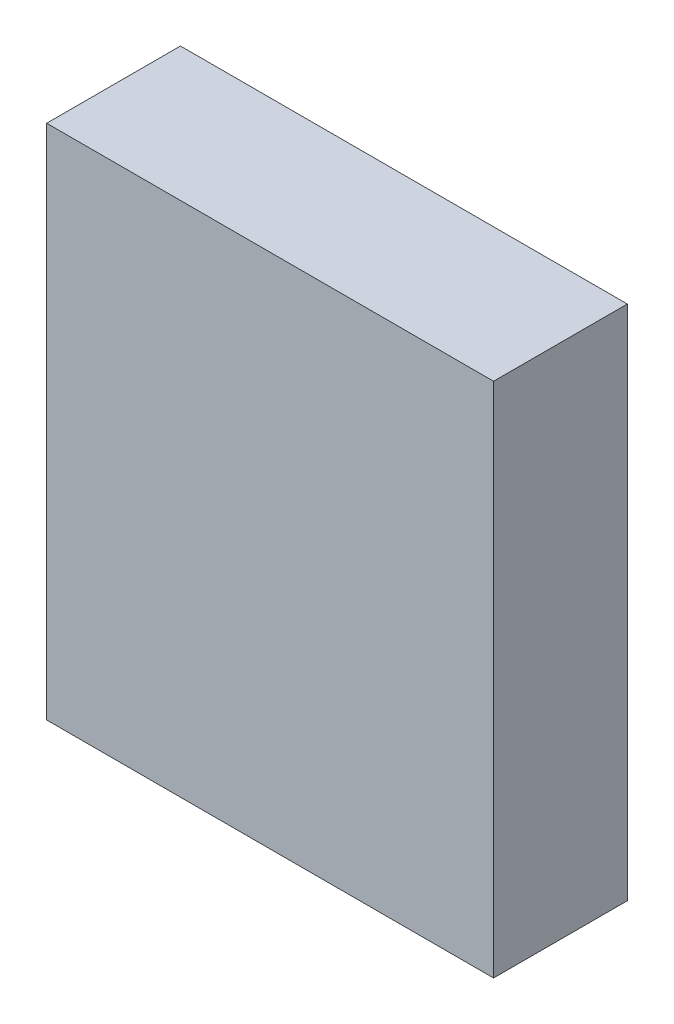
ISO-10303-21;
HEADER;
FILE_DESCRIPTION(('STEP AP214'),'2;1');
FILE_NAME('part.step','',(''),(''),'','','');
FILE_SCHEMA(('AUTOMOTIVE_DESIGN { 1 0 10303 214 1 1 1 1 }'));
ENDSEC;
DATA;
#1=APPLICATION_CONTEXT('core data for automotive mechanical design processes');
#2=APPLICATION_PROTOCOL_DEFINITION('international standard','automotive_design',2000,#1);
#3=PRODUCT_CONTEXT('',#1,'mechanical');
#4=PRODUCT('Part','Part','',(#3));
#5=PRODUCT_RELATED_PRODUCT_CATEGORY('part','',(#4));
#6=PRODUCT_DEFINITION_FORMATION('','',#4);
#7=PRODUCT_DEFINITION_CONTEXT('part definition',#1,'design');
#8=PRODUCT_DEFINITION('design','',#6,#7);
#9=PRODUCT_DEFINITION_SHAPE('','',#8);
#10=(LENGTH_UNIT() NAMED_UNIT(*) SI_UNIT(.MILLI.,.METRE.));
#11=(NAMED_UNIT(*) PLANE_ANGLE_UNIT() SI_UNIT($,.RADIAN.));
#12=(NAMED_UNIT(*) SI_UNIT($,.STERADIAN.) SOLID_ANGLE_UNIT());
#13=UNCERTAINTY_MEASURE_WITH_UNIT(LENGTH_MEASURE(1.E-05),#10,'distance_accuracy_value','');
#14=(GEOMETRIC_REPRESENTATION_CONTEXT(3) GLOBAL_UNCERTAINTY_ASSIGNED_CONTEXT((#13)) GLOBAL_UNIT_ASSIGNED_CONTEXT((#10,
#11,#12)) REPRESENTATION_CONTEXT('',''));
#15=CARTESIAN_POINT('',(0.,0.,0.));
#16=DIRECTION('',(0.,0.,1.));
#17=DIRECTION('',(1.,0.,0.));
#18=AXIS2_PLACEMENT_3D('',#15,#16,#17);
#19=CARTESIAN_POINT('',(0.,1700.,0.));
#20=DIRECTION('',(-1.,0.,0.));
#21=DIRECTION('',(0.,0.,1.));
#22=AXIS2_PLACEMENT_3D('',#19,#20,#21);
#23=PLANE('',#22);
#24=DIRECTION('',(0.,0.,-1.));
#25=VECTOR('',#24,1.);
#26=CARTESIAN_POINT('',(0.,0.,0.));
#27=LINE('',#26,#25);
#28=CARTESIAN_POINT('',(0.,0.,0.));
#29=VERTEX_POINT('',#28);
#30=CARTESIAN_POINT('',(0.,0.,-440.));
#31=VERTEX_POINT('',#30);
#32=EDGE_CURVE('E98',#29,#31,#27,.T.);
#33=ORIENTED_EDGE('',*,*,#32,.T.);
#34=DIRECTION('',(0.,-1.,0.));
#35=VECTOR('',#34,1.);
#36=CARTESIAN_POINT('',(0.,1700.,-440.));
#37=LINE('',#36,#35);
#38=CARTESIAN_POINT('',(0.,1700.,-440.));
#39=VERTEX_POINT('',#38);
#40=EDGE_CURVE('E11',#39,#31,#37,.T.);
#41=ORIENTED_EDGE('',*,*,#40,.F.);
#42=DIRECTION('',(0.,0.,-1.));
#43=VECTOR('',#42,1.);
#44=CARTESIAN_POINT('',(0.,1700.,0.));
#45=LINE('',#44,#43);
#46=CARTESIAN_POINT('',(0.,1700.,0.));
#47=VERTEX_POINT('',#46);
#48=EDGE_CURVE('E86',#47,#39,#45,.T.);
#49=ORIENTED_EDGE('',*,*,#48,.F.);
#50=DIRECTION('',(0.,-1.,0.));
#51=VECTOR('',#50,1.);
#52=CARTESIAN_POINT('',(0.,1700.,0.));
#53=LINE('',#52,#51);
#54=EDGE_CURVE('E94',#47,#29,#53,.T.);
#55=ORIENTED_EDGE('',*,*,#54,.T.);
#56=EDGE_LOOP('',(#33,#41,#49,#55));
#57=FACE_BOUND('',#56,.T.);
#58=ADVANCED_FACE('F35',(#57),#23,.F.);
#59=CARTESIAN_POINT('',(0.,1700.,-440.));
#60=DIRECTION('',(0.,0.,1.));
#61=DIRECTION('',(1.,0.,0.));
#62=AXIS2_PLACEMENT_3D('',#59,#60,#61);
#63=PLANE('',#62);
#64=DIRECTION('',(-1.,0.,0.));
#65=VECTOR('',#64,1.);
#66=CARTESIAN_POINT('',(0.,0.,-440.));
#67=LINE('',#66,#65);
#68=CARTESIAN_POINT('',(-1470.,0.,-440.));
#69=VERTEX_POINT('',#68);
#70=EDGE_CURVE('E90',#31,#69,#67,.T.);
#71=ORIENTED_EDGE('',*,*,#70,.T.);
#72=DIRECTION('',(0.,-1.,0.));
#73=VECTOR('',#72,1.);
#74=CARTESIAN_POINT('',(-1470.,1700.,-440.));
#75=LINE('',#74,#73);
#76=CARTESIAN_POINT('',(-1470.,1700.,-440.));
#77=VERTEX_POINT('',#76);
#78=EDGE_CURVE('E43',#77,#69,#75,.T.);
#79=ORIENTED_EDGE('',*,*,#78,.F.);
#80=DIRECTION('',(-1.,0.,0.));
#81=VECTOR('',#80,1.);
#82=CARTESIAN_POINT('',(0.,1700.,-440.));
#83=LINE('',#82,#81);
#84=EDGE_CURVE('E81',#39,#77,#83,.T.);
#85=ORIENTED_EDGE('',*,*,#84,.F.);
#86=ORIENTED_EDGE('',*,*,#40,.T.);
#87=EDGE_LOOP('',(#71,#79,#85,#86));
#88=FACE_BOUND('',#87,.T.);
#89=ADVANCED_FACE('F89',(#88),#63,.F.);
#90=CARTESIAN_POINT('',(-1470.,1700.,1.80023079474661E-13));
#91=DIRECTION('',(1.,0.,0.));
#92=DIRECTION('',(0.,0.,-1.));
#93=AXIS2_PLACEMENT_3D('',#90,#91,#92);
#94=PLANE('',#93);
#95=DIRECTION('',(0.,0.,1.));
#96=VECTOR('',#95,1.);
#97=CARTESIAN_POINT('',(-1470.,0.,1.80023079474661E-13));
#98=LINE('',#97,#96);
#99=CARTESIAN_POINT('',(-1470.,0.,1.80023079474661E-13));
#100=VERTEX_POINT('',#99);
#101=EDGE_CURVE('E68',#69,#100,#98,.T.);
#102=ORIENTED_EDGE('',*,*,#101,.T.);
#103=DIRECTION('',(0.,-1.,0.));
#104=VECTOR('',#103,1.);
#105=CARTESIAN_POINT('',(-1470.,1700.,1.80023079474661E-13));
#106=LINE('',#105,#104);
#107=CARTESIAN_POINT('',(-1470.,1700.,1.80023079474661E-13));
#108=VERTEX_POINT('',#107);
#109=EDGE_CURVE('E91',#108,#100,#106,.T.);
#110=ORIENTED_EDGE('',*,*,#109,.F.);
#111=DIRECTION('',(0.,0.,1.));
#112=VECTOR('',#111,1.);
#113=CARTESIAN_POINT('',(-1470.,1700.,1.80023079474661E-13));
#114=LINE('',#113,#112);
#115=EDGE_CURVE('E84',#77,#108,#114,.T.);
#116=ORIENTED_EDGE('',*,*,#115,.F.);
#117=ORIENTED_EDGE('',*,*,#78,.T.);
#118=EDGE_LOOP('',(#102,#110,#116,#117));
#119=FACE_BOUND('',#118,.T.);
#120=ADVANCED_FACE('F92',(#119),#94,.F.);
#121=CARTESIAN_POINT('',(0.,1700.,0.));
#122=DIRECTION('',(0.,0.,-1.));
#123=DIRECTION('',(-1.,0.,0.));
#124=AXIS2_PLACEMENT_3D('',#121,#122,#123);
#125=PLANE('',#124);
#126=DIRECTION('',(1.,0.,0.));
#127=VECTOR('',#126,1.);
#128=CARTESIAN_POINT('',(0.,0.,0.));
#129=LINE('',#128,#127);
#130=EDGE_CURVE('E74',#100,#29,#129,.T.);
#131=ORIENTED_EDGE('',*,*,#130,.T.);
#132=ORIENTED_EDGE('',*,*,#54,.F.);
#133=DIRECTION('',(1.,0.,0.));
#134=VECTOR('',#133,1.);
#135=CARTESIAN_POINT('',(0.,1700.,0.));
#136=LINE('',#135,#134);
#137=EDGE_CURVE('E51',#108,#47,#136,.T.);
#138=ORIENTED_EDGE('',*,*,#137,.F.);
#139=ORIENTED_EDGE('',*,*,#109,.T.);
#140=EDGE_LOOP('',(#131,#132,#138,#139));
#141=FACE_BOUND('',#140,.T.);
#142=ADVANCED_FACE('F105',(#141),#125,.F.);
#143=CARTESIAN_POINT('',(0.,1700.,0.));
#144=DIRECTION('',(0.,1.,0.));
#145=DIRECTION('',(0.,0.,1.));
#146=AXIS2_PLACEMENT_3D('',#143,#144,#145);
#147=PLANE('',#146);
#148=ORIENTED_EDGE('',*,*,#48,.T.);
#149=ORIENTED_EDGE('',*,*,#84,.T.);
#150=ORIENTED_EDGE('',*,*,#115,.T.);
#151=ORIENTED_EDGE('',*,*,#137,.T.);
#152=EDGE_LOOP('',(#148,#149,#150,#151));
#153=FACE_BOUND('',#152,.T.);
#154=ADVANCED_FACE('F82',(#153),#147,.T.);
#155=CARTESIAN_POINT('',(0.,0.,0.));
#156=DIRECTION('',(0.,1.,0.));
#157=DIRECTION('',(0.,0.,1.));
#158=AXIS2_PLACEMENT_3D('',#155,#156,#157);
#159=PLANE('',#158);
#160=ORIENTED_EDGE('',*,*,#32,.F.);
#161=ORIENTED_EDGE('',*,*,#130,.F.);
#162=ORIENTED_EDGE('',*,*,#101,.F.);
#163=ORIENTED_EDGE('',*,*,#70,.F.);
#164=EDGE_LOOP('',(#160,#161,#162,#163));
#165=FACE_BOUND('',#164,.T.);
#166=ADVANCED_FACE('F108',(#165),#159,.F.);
#167=CLOSED_SHELL('',(#58,#89,#120,#142,#154,#166));
#168=MANIFOLD_SOLID_BREP('B2',#167);
#169=ADVANCED_BREP_SHAPE_REPRESENTATION('',(#18,#168),#14);
#170=SHAPE_DEFINITION_REPRESENTATION(#9,#169);
ENDSEC;
END-ISO-10303-21;
